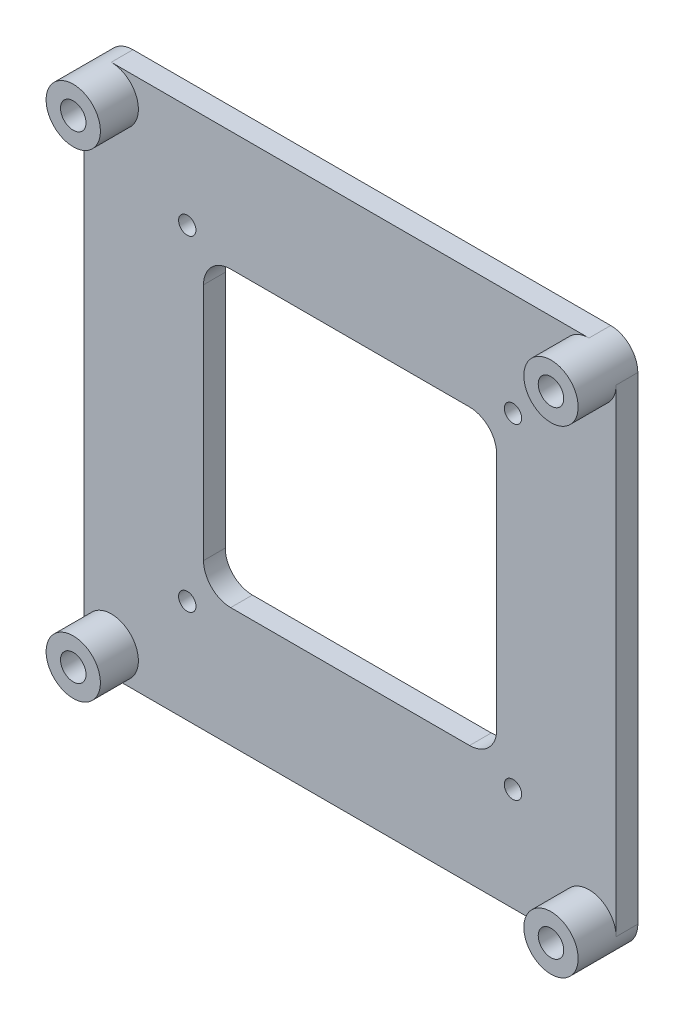
ISO-10303-21;
HEADER;
FILE_DESCRIPTION(('STEP AP214'),'2;1');
FILE_NAME('part.step','',(''),(''),'','','');
FILE_SCHEMA(('AUTOMOTIVE_DESIGN { 1 0 10303 214 1 1 1 1 }'));
ENDSEC;
DATA;
#1=APPLICATION_CONTEXT('core data for automotive mechanical design processes');
#2=APPLICATION_PROTOCOL_DEFINITION('international standard','automotive_design',2000,#1);
#3=PRODUCT_CONTEXT('',#1,'mechanical');
#4=PRODUCT('Part','Part','',(#3));
#5=PRODUCT_RELATED_PRODUCT_CATEGORY('part','',(#4));
#6=PRODUCT_DEFINITION_FORMATION('','',#4);
#7=PRODUCT_DEFINITION_CONTEXT('part definition',#1,'design');
#8=PRODUCT_DEFINITION('design','',#6,#7);
#9=PRODUCT_DEFINITION_SHAPE('','',#8);
#10=(LENGTH_UNIT() NAMED_UNIT(*) SI_UNIT(.MILLI.,.METRE.));
#11=(NAMED_UNIT(*) PLANE_ANGLE_UNIT() SI_UNIT($,.RADIAN.));
#12=(NAMED_UNIT(*) SI_UNIT($,.STERADIAN.) SOLID_ANGLE_UNIT());
#13=UNCERTAINTY_MEASURE_WITH_UNIT(LENGTH_MEASURE(1.E-05),#10,'distance_accuracy_value','');
#14=(GEOMETRIC_REPRESENTATION_CONTEXT(3) GLOBAL_UNCERTAINTY_ASSIGNED_CONTEXT((#13)) GLOBAL_UNIT_ASSIGNED_CONTEXT((#10,
#11,#12)) REPRESENTATION_CONTEXT('',''));
#15=CARTESIAN_POINT('',(0.,0.,0.));
#16=DIRECTION('',(0.,0.,1.));
#17=DIRECTION('',(1.,0.,0.));
#18=AXIS2_PLACEMENT_3D('',#15,#16,#17);
#19=CARTESIAN_POINT('',(0.,0.,0.));
#20=DIRECTION('',(0.,0.,1.));
#21=DIRECTION('',(1.,0.,0.));
#22=AXIS2_PLACEMENT_3D('',#19,#20,#21);
#23=PLANE('',#22);
#24=CARTESIAN_POINT('',(30.,30.,0.));
#25=DIRECTION('',(0.,0.,-1.));
#26=DIRECTION('',(1.,0.,0.));
#27=AXIS2_PLACEMENT_3D('',#24,#25,#26);
#28=CIRCLE('',#27,1.6);
#29=CARTESIAN_POINT('',(28.4,30.,0.));
#30=VERTEX_POINT('',#29);
#31=EDGE_CURVE('E338',#30,#30,#28,.T.);
#32=ORIENTED_EDGE('',*,*,#31,.F.);
#33=EDGE_LOOP('',(#32));
#34=FACE_BOUND('',#33,.T.);
#35=CARTESIAN_POINT('',(-30.,30.,0.));
#36=DIRECTION('',(0.,0.,-1.));
#37=DIRECTION('',(1.,0.,0.));
#38=AXIS2_PLACEMENT_3D('',#35,#36,#37);
#39=CIRCLE('',#38,1.6);
#40=CARTESIAN_POINT('',(-31.6,30.,0.));
#41=VERTEX_POINT('',#40);
#42=EDGE_CURVE('E322',#41,#41,#39,.T.);
#43=ORIENTED_EDGE('',*,*,#42,.F.);
#44=EDGE_LOOP('',(#43));
#45=FACE_BOUND('',#44,.T.);
#46=CARTESIAN_POINT('',(-30.,-30.,0.));
#47=DIRECTION('',(0.,0.,-1.));
#48=DIRECTION('',(1.,0.,0.));
#49=AXIS2_PLACEMENT_3D('',#46,#47,#48);
#50=CIRCLE('',#49,1.6);
#51=CARTESIAN_POINT('',(-31.6,-30.,0.));
#52=VERTEX_POINT('',#51);
#53=EDGE_CURVE('E245',#52,#52,#50,.T.);
#54=ORIENTED_EDGE('',*,*,#53,.F.);
#55=EDGE_LOOP('',(#54));
#56=FACE_BOUND('',#55,.T.);
#57=CARTESIAN_POINT('',(22.,22.,0.));
#58=DIRECTION('',(0.,0.,-1.));
#59=DIRECTION('',(0.707106781186548,0.707106781186548,0.));
#60=AXIS2_PLACEMENT_3D('',#57,#58,#59);
#61=CIRCLE('',#60,5.);
#62=CARTESIAN_POINT('',(22.,27.,0.));
#63=VERTEX_POINT('',#62);
#64=CARTESIAN_POINT('',(27.,22.,0.));
#65=VERTEX_POINT('',#64);
#66=EDGE_CURVE('E797',#63,#65,#61,.T.);
#67=ORIENTED_EDGE('',*,*,#66,.F.);
#68=DIRECTION('',(1.,0.,0.));
#69=VECTOR('',#68,1.);
#70=CARTESIAN_POINT('',(-27.,27.,0.));
#71=LINE('',#70,#69);
#72=CARTESIAN_POINT('',(-22.,27.,0.));
#73=VERTEX_POINT('',#72);
#74=EDGE_CURVE('E819',#73,#63,#71,.T.);
#75=ORIENTED_EDGE('',*,*,#74,.F.);
#76=CARTESIAN_POINT('',(-22.,22.,0.));
#77=DIRECTION('',(0.,0.,-1.));
#78=DIRECTION('',(-0.707106781186548,0.707106781186548,0.));
#79=AXIS2_PLACEMENT_3D('',#76,#77,#78);
#80=CIRCLE('',#79,5.);
#81=CARTESIAN_POINT('',(-27.,22.,0.));
#82=VERTEX_POINT('',#81);
#83=EDGE_CURVE('E847',#82,#73,#80,.T.);
#84=ORIENTED_EDGE('',*,*,#83,.F.);
#85=DIRECTION('',(0.,1.,0.));
#86=VECTOR('',#85,1.);
#87=CARTESIAN_POINT('',(-27.,-27.,0.));
#88=LINE('',#87,#86);
#89=CARTESIAN_POINT('',(-27.,-22.,0.));
#90=VERTEX_POINT('',#89);
#91=EDGE_CURVE('E678',#90,#82,#88,.T.);
#92=ORIENTED_EDGE('',*,*,#91,.F.);
#93=CARTESIAN_POINT('',(-22.,-22.,0.));
#94=DIRECTION('',(0.,0.,-1.));
#95=DIRECTION('',(-0.707106781186548,-0.707106781186548,0.));
#96=AXIS2_PLACEMENT_3D('',#93,#94,#95);
#97=CIRCLE('',#96,5.);
#98=CARTESIAN_POINT('',(-22.,-27.,0.));
#99=VERTEX_POINT('',#98);
#100=EDGE_CURVE('E708',#99,#90,#97,.T.);
#101=ORIENTED_EDGE('',*,*,#100,.F.);
#102=DIRECTION('',(-1.,0.,0.));
#103=VECTOR('',#102,1.);
#104=CARTESIAN_POINT('',(27.,-27.,0.));
#105=LINE('',#104,#103);
#106=CARTESIAN_POINT('',(22.,-27.,0.));
#107=VERTEX_POINT('',#106);
#108=EDGE_CURVE('E731',#107,#99,#105,.T.);
#109=ORIENTED_EDGE('',*,*,#108,.F.);
#110=CARTESIAN_POINT('',(22.,-22.,0.));
#111=DIRECTION('',(0.,0.,-1.));
#112=DIRECTION('',(0.707106781186548,-0.707106781186548,0.));
#113=AXIS2_PLACEMENT_3D('',#110,#111,#112);
#114=CIRCLE('',#113,5.);
#115=CARTESIAN_POINT('',(27.,-22.,0.));
#116=VERTEX_POINT('',#115);
#117=EDGE_CURVE('E753',#116,#107,#114,.T.);
#118=ORIENTED_EDGE('',*,*,#117,.F.);
#119=DIRECTION('',(0.,-1.,0.));
#120=VECTOR('',#119,1.);
#121=CARTESIAN_POINT('',(27.,27.,0.));
#122=LINE('',#121,#120);
#123=EDGE_CURVE('E777',#65,#116,#122,.T.);
#124=ORIENTED_EDGE('',*,*,#123,.F.);
#125=EDGE_LOOP('',(#67,#75,#84,#92,#101,#109,#118,#124));
#126=FACE_BOUND('',#125,.T.);
#127=CARTESIAN_POINT('',(30.,-30.,0.));
#128=DIRECTION('',(0.,0.,-1.));
#129=DIRECTION('',(1.,0.,0.));
#130=AXIS2_PLACEMENT_3D('',#127,#128,#129);
#131=CIRCLE('',#130,1.6);
#132=CARTESIAN_POINT('',(28.4,-30.,0.));
#133=VERTEX_POINT('',#132);
#134=EDGE_CURVE('E229',#133,#133,#131,.T.);
#135=ORIENTED_EDGE('',*,*,#134,.F.);
#136=EDGE_LOOP('',(#135));
#137=FACE_BOUND('',#136,.T.);
#138=CARTESIAN_POINT('',(44.,44.,0.));
#139=DIRECTION('',(0.,0.,-1.));
#140=DIRECTION('',(1.,0.,0.));
#141=AXIS2_PLACEMENT_3D('',#138,#139,#140);
#142=CIRCLE('',#141,2.35);
#143=CARTESIAN_POINT('',(41.65,44.,0.));
#144=VERTEX_POINT('',#143);
#145=EDGE_CURVE('E243',#144,#144,#142,.T.);
#146=ORIENTED_EDGE('',*,*,#145,.F.);
#147=EDGE_LOOP('',(#146));
#148=FACE_BOUND('',#147,.T.);
#149=CARTESIAN_POINT('',(44.,-44.,0.));
#150=DIRECTION('',(0.,0.,-1.));
#151=DIRECTION('',(1.,0.,0.));
#152=AXIS2_PLACEMENT_3D('',#149,#150,#151);
#153=CIRCLE('',#152,2.35);
#154=CARTESIAN_POINT('',(41.65,-44.,0.));
#155=VERTEX_POINT('',#154);
#156=EDGE_CURVE('E254',#155,#155,#153,.T.);
#157=ORIENTED_EDGE('',*,*,#156,.F.);
#158=EDGE_LOOP('',(#157));
#159=FACE_BOUND('',#158,.T.);
#160=CARTESIAN_POINT('',(-44.,-44.,0.));
#161=DIRECTION('',(0.,0.,-1.));
#162=DIRECTION('',(1.,0.,0.));
#163=AXIS2_PLACEMENT_3D('',#160,#161,#162);
#164=CIRCLE('',#163,2.35);
#165=CARTESIAN_POINT('',(-46.35,-44.,0.));
#166=VERTEX_POINT('',#165);
#167=EDGE_CURVE('E48',#166,#166,#164,.T.);
#168=ORIENTED_EDGE('',*,*,#167,.F.);
#169=EDGE_LOOP('',(#168));
#170=FACE_BOUND('',#169,.T.);
#171=CARTESIAN_POINT('',(-44.,44.,0.));
#172=DIRECTION('',(0.,0.,-1.));
#173=DIRECTION('',(1.,0.,0.));
#174=AXIS2_PLACEMENT_3D('',#171,#172,#173);
#175=CIRCLE('',#174,2.35);
#176=CARTESIAN_POINT('',(-46.35,44.,0.));
#177=VERTEX_POINT('',#176);
#178=EDGE_CURVE('E25',#177,#177,#175,.T.);
#179=ORIENTED_EDGE('',*,*,#178,.F.);
#180=EDGE_LOOP('',(#179));
#181=FACE_BOUND('',#180,.T.);
#182=CARTESIAN_POINT('',(-44.,44.,0.));
#183=DIRECTION('',(0.,0.,1.));
#184=DIRECTION('',(-0.707106781186548,0.707106781186548,0.));
#185=AXIS2_PLACEMENT_3D('',#182,#183,#184);
#186=CIRCLE('',#185,5.);
#187=CARTESIAN_POINT('',(-44.,49.,0.));
#188=VERTEX_POINT('',#187);
#189=CARTESIAN_POINT('',(-49.,44.,0.));
#190=VERTEX_POINT('',#189);
#191=EDGE_CURVE('E393',#188,#190,#186,.T.);
#192=ORIENTED_EDGE('',*,*,#191,.F.);
#193=DIRECTION('',(-1.,0.,0.));
#194=VECTOR('',#193,1.);
#195=CARTESIAN_POINT('',(49.,49.,0.));
#196=LINE('',#195,#194);
#197=CARTESIAN_POINT('',(44.,49.,0.));
#198=VERTEX_POINT('',#197);
#199=EDGE_CURVE('E10',#198,#188,#196,.T.);
#200=ORIENTED_EDGE('',*,*,#199,.F.);
#201=CARTESIAN_POINT('',(44.,44.,0.));
#202=DIRECTION('',(0.,0.,1.));
#203=DIRECTION('',(0.707106781186548,0.707106781186548,0.));
#204=AXIS2_PLACEMENT_3D('',#201,#202,#203);
#205=CIRCLE('',#204,5.);
#206=CARTESIAN_POINT('',(49.,44.,0.));
#207=VERTEX_POINT('',#206);
#208=EDGE_CURVE('E556',#207,#198,#205,.T.);
#209=ORIENTED_EDGE('',*,*,#208,.F.);
#210=DIRECTION('',(0.,1.,0.));
#211=VECTOR('',#210,1.);
#212=CARTESIAN_POINT('',(49.,-49.,0.));
#213=LINE('',#212,#211);
#214=CARTESIAN_POINT('',(49.,-44.,0.));
#215=VERTEX_POINT('',#214);
#216=EDGE_CURVE('E614',#215,#207,#213,.T.);
#217=ORIENTED_EDGE('',*,*,#216,.F.);
#218=CARTESIAN_POINT('',(44.,-44.,0.));
#219=DIRECTION('',(0.,0.,1.));
#220=DIRECTION('',(0.707106781186548,-0.707106781186548,0.));
#221=AXIS2_PLACEMENT_3D('',#218,#219,#220);
#222=CIRCLE('',#221,5.);
#223=CARTESIAN_POINT('',(44.,-49.,0.));
#224=VERTEX_POINT('',#223);
#225=EDGE_CURVE('E432',#224,#215,#222,.T.);
#226=ORIENTED_EDGE('',*,*,#225,.F.);
#227=DIRECTION('',(1.,0.,0.));
#228=VECTOR('',#227,1.);
#229=CARTESIAN_POINT('',(-49.,-49.,0.));
#230=LINE('',#229,#228);
#231=CARTESIAN_POINT('',(-44.,-49.,0.));
#232=VERTEX_POINT('',#231);
#233=EDGE_CURVE('E580',#232,#224,#230,.T.);
#234=ORIENTED_EDGE('',*,*,#233,.F.);
#235=CARTESIAN_POINT('',(-44.,-44.,0.));
#236=DIRECTION('',(0.,0.,1.));
#237=DIRECTION('',(-0.707106781186548,-0.707106781186548,0.));
#238=AXIS2_PLACEMENT_3D('',#235,#236,#237);
#239=CIRCLE('',#238,5.);
#240=CARTESIAN_POINT('',(-49.,-44.,0.));
#241=VERTEX_POINT('',#240);
#242=EDGE_CURVE('E361',#241,#232,#239,.T.);
#243=ORIENTED_EDGE('',*,*,#242,.F.);
#244=DIRECTION('',(0.,-1.,0.));
#245=VECTOR('',#244,1.);
#246=CARTESIAN_POINT('',(-49.,49.,0.));
#247=LINE('',#246,#245);
#248=EDGE_CURVE('E662',#190,#241,#247,.T.);
#249=ORIENTED_EDGE('',*,*,#248,.F.);
#250=EDGE_LOOP('',(#192,#200,#209,#217,#226,#234,#243,#249));
#251=FACE_BOUND('',#250,.T.);
#252=ADVANCED_FACE('F16',(#34,#45,#56,#126,#137,#148,#159,#170,#181,#251),#23,.F.);
#253=CARTESIAN_POINT('',(49.,49.,0.));
#254=DIRECTION('',(0.,1.,0.));
#255=DIRECTION('',(1.,0.,0.));
#256=AXIS2_PLACEMENT_3D('',#253,#254,#255);
#257=PLANE('',#256);
#258=DIRECTION('',(0.,0.,-1.));
#259=VECTOR('',#258,1.);
#260=CARTESIAN_POINT('',(-44.,49.,0.));
#261=LINE('',#260,#259);
#262=CARTESIAN_POINT('',(-44.,49.,4.));
#263=VERTEX_POINT('',#262);
#264=EDGE_CURVE('E400',#263,#188,#261,.T.);
#265=ORIENTED_EDGE('',*,*,#264,.F.);
#266=DIRECTION('',(-1.,0.,0.));
#267=VECTOR('',#266,1.);
#268=CARTESIAN_POINT('',(49.,49.,4.));
#269=LINE('',#268,#267);
#270=CARTESIAN_POINT('',(44.,49.,4.));
#271=VERTEX_POINT('',#270);
#272=EDGE_CURVE('E528',#271,#263,#269,.T.);
#273=ORIENTED_EDGE('',*,*,#272,.F.);
#274=DIRECTION('',(0.,0.,1.));
#275=VECTOR('',#274,1.);
#276=CARTESIAN_POINT('',(44.,49.,0.));
#277=LINE('',#276,#275);
#278=EDGE_CURVE('E549',#198,#271,#277,.T.);
#279=ORIENTED_EDGE('',*,*,#278,.F.);
#280=ORIENTED_EDGE('',*,*,#199,.T.);
#281=EDGE_LOOP('',(#265,#273,#279,#280));
#282=FACE_BOUND('',#281,.T.);
#283=ADVANCED_FACE('F18',(#282),#257,.T.);
#284=CARTESIAN_POINT('',(-44.,44.,0.));
#285=DIRECTION('',(0.,0.,1.));
#286=DIRECTION('',(1.,0.,0.));
#287=AXIS2_PLACEMENT_3D('',#284,#285,#286);
#288=CYLINDRICAL_SURFACE('',#287,2.35);
#289=CARTESIAN_POINT('',(-44.,44.,11.));
#290=DIRECTION('',(0.,0.,-1.));
#291=DIRECTION('',(-1.,0.,0.));
#292=AXIS2_PLACEMENT_3D('',#289,#290,#291);
#293=CIRCLE('',#292,2.35);
#294=CARTESIAN_POINT('',(-46.35,44.,11.));
#295=VERTEX_POINT('',#294);
#296=EDGE_CURVE('E385',#295,#295,#293,.T.);
#297=ORIENTED_EDGE('',*,*,#296,.F.);
#298=DIRECTION('',(0.,0.,-1.));
#299=VECTOR('',#298,1.);
#300=CARTESIAN_POINT('',(-46.35,44.,0.));
#301=LINE('',#300,#299);
#302=EDGE_CURVE('E258',#295,#177,#301,.T.);
#303=ORIENTED_EDGE('',*,*,#302,.T.);
#304=ORIENTED_EDGE('',*,*,#178,.T.);
#305=ORIENTED_EDGE('',*,*,#302,.F.);
#306=EDGE_LOOP('',(#297,#303,#304,#305));
#307=FACE_BOUND('',#306,.T.);
#308=ADVANCED_FACE('F913',(#307),#288,.F.);
#309=CARTESIAN_POINT('',(-44.,-44.,0.));
#310=DIRECTION('',(0.,0.,1.));
#311=DIRECTION('',(1.,0.,0.));
#312=AXIS2_PLACEMENT_3D('',#309,#310,#311);
#313=CYLINDRICAL_SURFACE('',#312,2.35);
#314=CARTESIAN_POINT('',(-44.,-44.,11.));
#315=DIRECTION('',(0.,0.,-1.));
#316=DIRECTION('',(-1.,0.,0.));
#317=AXIS2_PLACEMENT_3D('',#314,#315,#316);
#318=CIRCLE('',#317,2.35);
#319=CARTESIAN_POINT('',(-46.35,-44.,11.));
#320=VERTEX_POINT('',#319);
#321=EDGE_CURVE('E352',#320,#320,#318,.T.);
#322=ORIENTED_EDGE('',*,*,#321,.F.);
#323=DIRECTION('',(0.,0.,-1.));
#324=VECTOR('',#323,1.);
#325=CARTESIAN_POINT('',(-46.35,-44.,0.));
#326=LINE('',#325,#324);
#327=EDGE_CURVE('E257',#320,#166,#326,.T.);
#328=ORIENTED_EDGE('',*,*,#327,.T.);
#329=ORIENTED_EDGE('',*,*,#167,.T.);
#330=ORIENTED_EDGE('',*,*,#327,.F.);
#331=EDGE_LOOP('',(#322,#328,#329,#330));
#332=FACE_BOUND('',#331,.T.);
#333=ADVANCED_FACE('F1020',(#332),#313,.F.);
#334=CARTESIAN_POINT('',(44.,-44.,0.));
#335=DIRECTION('',(0.,0.,1.));
#336=DIRECTION('',(1.,0.,0.));
#337=AXIS2_PLACEMENT_3D('',#334,#335,#336);
#338=CYLINDRICAL_SURFACE('',#337,2.35);
#339=CARTESIAN_POINT('',(44.,-44.,11.));
#340=DIRECTION('',(0.,0.,-1.));
#341=DIRECTION('',(-1.,0.,0.));
#342=AXIS2_PLACEMENT_3D('',#339,#340,#341);
#343=CIRCLE('',#342,2.35);
#344=CARTESIAN_POINT('',(41.65,-44.,11.));
#345=VERTEX_POINT('',#344);
#346=EDGE_CURVE('E423',#345,#345,#343,.T.);
#347=ORIENTED_EDGE('',*,*,#346,.F.);
#348=DIRECTION('',(0.,0.,-1.));
#349=VECTOR('',#348,1.);
#350=CARTESIAN_POINT('',(41.65,-44.,0.));
#351=LINE('',#350,#349);
#352=EDGE_CURVE('E253',#345,#155,#351,.T.);
#353=ORIENTED_EDGE('',*,*,#352,.T.);
#354=ORIENTED_EDGE('',*,*,#156,.T.);
#355=ORIENTED_EDGE('',*,*,#352,.F.);
#356=EDGE_LOOP('',(#347,#353,#354,#355));
#357=FACE_BOUND('',#356,.T.);
#358=ADVANCED_FACE('F1016',(#357),#338,.F.);
#359=CARTESIAN_POINT('',(44.,44.,0.));
#360=DIRECTION('',(0.,0.,1.));
#361=DIRECTION('',(1.,0.,0.));
#362=AXIS2_PLACEMENT_3D('',#359,#360,#361);
#363=CYLINDRICAL_SURFACE('',#362,2.35);
#364=CARTESIAN_POINT('',(44.,44.,11.));
#365=DIRECTION('',(0.,0.,-1.));
#366=DIRECTION('',(-1.,0.,0.));
#367=AXIS2_PLACEMENT_3D('',#364,#365,#366);
#368=CIRCLE('',#367,2.35);
#369=CARTESIAN_POINT('',(41.65,44.,11.));
#370=VERTEX_POINT('',#369);
#371=EDGE_CURVE('E535',#370,#370,#368,.T.);
#372=ORIENTED_EDGE('',*,*,#371,.F.);
#373=DIRECTION('',(0.,0.,-1.));
#374=VECTOR('',#373,1.);
#375=CARTESIAN_POINT('',(41.65,44.,0.));
#376=LINE('',#375,#374);
#377=EDGE_CURVE('E236',#370,#144,#376,.T.);
#378=ORIENTED_EDGE('',*,*,#377,.T.);
#379=ORIENTED_EDGE('',*,*,#145,.T.);
#380=ORIENTED_EDGE('',*,*,#377,.F.);
#381=EDGE_LOOP('',(#372,#378,#379,#380));
#382=FACE_BOUND('',#381,.T.);
#383=ADVANCED_FACE('F1013',(#382),#363,.F.);
#384=CARTESIAN_POINT('',(30.,-30.,0.));
#385=DIRECTION('',(0.,0.,1.));
#386=DIRECTION('',(1.,0.,0.));
#387=AXIS2_PLACEMENT_3D('',#384,#385,#386);
#388=CYLINDRICAL_SURFACE('',#387,1.6);
#389=CARTESIAN_POINT('',(30.,-30.,4.));
#390=DIRECTION('',(0.,0.,-1.));
#391=DIRECTION('',(1.,0.,0.));
#392=AXIS2_PLACEMENT_3D('',#389,#390,#391);
#393=CIRCLE('',#392,1.6);
#394=CARTESIAN_POINT('',(28.4,-30.,4.));
#395=VERTEX_POINT('',#394);
#396=EDGE_CURVE('E455',#395,#395,#393,.T.);
#397=ORIENTED_EDGE('',*,*,#396,.F.);
#398=DIRECTION('',(0.,0.,-1.));
#399=VECTOR('',#398,1.);
#400=CARTESIAN_POINT('',(28.4,-30.,0.));
#401=LINE('',#400,#399);
#402=EDGE_CURVE('E232',#395,#133,#401,.T.);
#403=ORIENTED_EDGE('',*,*,#402,.T.);
#404=ORIENTED_EDGE('',*,*,#134,.T.);
#405=ORIENTED_EDGE('',*,*,#402,.F.);
#406=EDGE_LOOP('',(#397,#403,#404,#405));
#407=FACE_BOUND('',#406,.T.);
#408=ADVANCED_FACE('F231',(#407),#388,.F.);
#409=CARTESIAN_POINT('',(-30.,-30.,0.));
#410=DIRECTION('',(0.,0.,1.));
#411=DIRECTION('',(1.,0.,0.));
#412=AXIS2_PLACEMENT_3D('',#409,#410,#411);
#413=CYLINDRICAL_SURFACE('',#412,1.6);
#414=CARTESIAN_POINT('',(-30.,-30.,4.));
#415=DIRECTION('',(0.,0.,-1.));
#416=DIRECTION('',(1.,0.,0.));
#417=AXIS2_PLACEMENT_3D('',#414,#415,#416);
#418=CIRCLE('',#417,1.6);
#419=CARTESIAN_POINT('',(-31.6,-30.,4.));
#420=VERTEX_POINT('',#419);
#421=EDGE_CURVE('E462',#420,#420,#418,.T.);
#422=ORIENTED_EDGE('',*,*,#421,.F.);
#423=DIRECTION('',(0.,0.,-1.));
#424=VECTOR('',#423,1.);
#425=CARTESIAN_POINT('',(-31.6,-30.,0.));
#426=LINE('',#425,#424);
#427=EDGE_CURVE('E249',#420,#52,#426,.T.);
#428=ORIENTED_EDGE('',*,*,#427,.T.);
#429=ORIENTED_EDGE('',*,*,#53,.T.);
#430=ORIENTED_EDGE('',*,*,#427,.F.);
#431=EDGE_LOOP('',(#422,#428,#429,#430));
#432=FACE_BOUND('',#431,.T.);
#433=ADVANCED_FACE('F1006',(#432),#413,.F.);
#434=CARTESIAN_POINT('',(-30.,30.,0.));
#435=DIRECTION('',(0.,0.,1.));
#436=DIRECTION('',(1.,0.,0.));
#437=AXIS2_PLACEMENT_3D('',#434,#435,#436);
#438=CYLINDRICAL_SURFACE('',#437,1.6);
#439=CARTESIAN_POINT('',(-30.,30.,4.));
#440=DIRECTION('',(0.,0.,-1.));
#441=DIRECTION('',(1.,0.,0.));
#442=AXIS2_PLACEMENT_3D('',#439,#440,#441);
#443=CIRCLE('',#442,1.6);
#444=CARTESIAN_POINT('',(-31.6,30.,4.));
#445=VERTEX_POINT('',#444);
#446=EDGE_CURVE('E470',#445,#445,#443,.T.);
#447=ORIENTED_EDGE('',*,*,#446,.F.);
#448=DIRECTION('',(0.,0.,-1.));
#449=VECTOR('',#448,1.);
#450=CARTESIAN_POINT('',(-31.6,30.,0.));
#451=LINE('',#450,#449);
#452=EDGE_CURVE('E329',#445,#41,#451,.T.);
#453=ORIENTED_EDGE('',*,*,#452,.T.);
#454=ORIENTED_EDGE('',*,*,#42,.T.);
#455=ORIENTED_EDGE('',*,*,#452,.F.);
#456=EDGE_LOOP('',(#447,#453,#454,#455));
#457=FACE_BOUND('',#456,.T.);
#458=ADVANCED_FACE('F999',(#457),#438,.F.);
#459=CARTESIAN_POINT('',(30.,30.,0.));
#460=DIRECTION('',(0.,0.,1.));
#461=DIRECTION('',(1.,0.,0.));
#462=AXIS2_PLACEMENT_3D('',#459,#460,#461);
#463=CYLINDRICAL_SURFACE('',#462,1.6);
#464=CARTESIAN_POINT('',(30.,30.,4.));
#465=DIRECTION('',(0.,0.,-1.));
#466=DIRECTION('',(1.,0.,0.));
#467=AXIS2_PLACEMENT_3D('',#464,#465,#466);
#468=CIRCLE('',#467,1.6);
#469=CARTESIAN_POINT('',(28.4,30.,4.));
#470=VERTEX_POINT('',#469);
#471=EDGE_CURVE('E478',#470,#470,#468,.T.);
#472=ORIENTED_EDGE('',*,*,#471,.F.);
#473=DIRECTION('',(0.,0.,-1.));
#474=VECTOR('',#473,1.);
#475=CARTESIAN_POINT('',(28.4,30.,0.));
#476=LINE('',#475,#474);
#477=EDGE_CURVE('E344',#470,#30,#476,.T.);
#478=ORIENTED_EDGE('',*,*,#477,.T.);
#479=ORIENTED_EDGE('',*,*,#31,.T.);
#480=ORIENTED_EDGE('',*,*,#477,.F.);
#481=EDGE_LOOP('',(#472,#478,#479,#480));
#482=FACE_BOUND('',#481,.T.);
#483=ADVANCED_FACE('F990',(#482),#463,.F.);
#484=CARTESIAN_POINT('',(-44.,-44.,11.));
#485=DIRECTION('',(0.,0.,1.));
#486=DIRECTION('',(1.,0.,0.));
#487=AXIS2_PLACEMENT_3D('',#484,#485,#486);
#488=PLANE('',#487);
#489=ORIENTED_EDGE('',*,*,#321,.T.);
#490=EDGE_LOOP('',(#489));
#491=FACE_BOUND('',#490,.T.);
#492=CARTESIAN_POINT('',(-44.,-44.,11.));
#493=DIRECTION('',(0.,0.,1.));
#494=DIRECTION('',(-1.,0.,0.));
#495=AXIS2_PLACEMENT_3D('',#492,#493,#494);
#496=CIRCLE('',#495,5.);
#497=CARTESIAN_POINT('',(-39.,-44.,11.));
#498=VERTEX_POINT('',#497);
#499=EDGE_CURVE('E377',#498,#498,#496,.T.);
#500=ORIENTED_EDGE('',*,*,#499,.T.);
#501=EDGE_LOOP('',(#500));
#502=FACE_BOUND('',#501,.T.);
#503=ADVANCED_FACE('F988',(#491,#502),#488,.T.);
#504=CARTESIAN_POINT('',(-44.,-44.,4.));
#505=DIRECTION('',(0.,0.,1.));
#506=DIRECTION('',(-1.,0.,0.));
#507=AXIS2_PLACEMENT_3D('',#504,#505,#506);
#508=CYLINDRICAL_SURFACE('',#507,5.);
#509=ORIENTED_EDGE('',*,*,#499,.F.);
#510=DIRECTION('',(0.,0.,-1.));
#511=VECTOR('',#510,1.);
#512=CARTESIAN_POINT('',(-39.,-44.,4.));
#513=LINE('',#512,#511);
#514=CARTESIAN_POINT('',(-39.,-44.,4.));
#515=VERTEX_POINT('',#514);
#516=EDGE_CURVE('E368',#498,#515,#513,.T.);
#517=ORIENTED_EDGE('',*,*,#516,.T.);
#518=CARTESIAN_POINT('',(-44.,-44.,4.));
#519=DIRECTION('',(0.,0.,-1.));
#520=DIRECTION('',(-1.,0.,0.));
#521=AXIS2_PLACEMENT_3D('',#518,#519,#520);
#522=CIRCLE('',#521,5.);
#523=CARTESIAN_POINT('',(-49.,-44.,4.));
#524=VERTEX_POINT('',#523);
#525=EDGE_CURVE('E505',#524,#515,#522,.T.);
#526=ORIENTED_EDGE('',*,*,#525,.F.);
#527=DIRECTION('',(0.,0.,-1.));
#528=VECTOR('',#527,1.);
#529=CARTESIAN_POINT('',(-49.,-44.,0.));
#530=LINE('',#529,#528);
#531=EDGE_CURVE('E654',#524,#241,#530,.T.);
#532=ORIENTED_EDGE('',*,*,#531,.T.);
#533=ORIENTED_EDGE('',*,*,#242,.T.);
#534=DIRECTION('',(0.,0.,1.));
#535=VECTOR('',#534,1.);
#536=CARTESIAN_POINT('',(-44.,-49.,0.));
#537=LINE('',#536,#535);
#538=CARTESIAN_POINT('',(-44.,-49.,4.));
#539=VERTEX_POINT('',#538);
#540=EDGE_CURVE('E588',#232,#539,#537,.T.);
#541=ORIENTED_EDGE('',*,*,#540,.T.);
#542=CARTESIAN_POINT('',(-44.,-44.,4.));
#543=DIRECTION('',(0.,0.,-1.));
#544=DIRECTION('',(-1.,0.,0.));
#545=AXIS2_PLACEMENT_3D('',#542,#543,#544);
#546=CIRCLE('',#545,5.);
#547=EDGE_CURVE('E497',#515,#539,#546,.T.);
#548=ORIENTED_EDGE('',*,*,#547,.F.);
#549=ORIENTED_EDGE('',*,*,#516,.F.);
#550=EDGE_LOOP('',(#509,#517,#526,#532,#533,#541,#548,#549));
#551=FACE_BOUND('',#550,.T.);
#552=ADVANCED_FACE('F986',(#551),#508,.T.);
#553=CARTESIAN_POINT('',(-44.,44.,11.));
#554=DIRECTION('',(0.,0.,1.));
#555=DIRECTION('',(1.,0.,0.));
#556=AXIS2_PLACEMENT_3D('',#553,#554,#555);
#557=PLANE('',#556);
#558=ORIENTED_EDGE('',*,*,#296,.T.);
#559=EDGE_LOOP('',(#558));
#560=FACE_BOUND('',#559,.T.);
#561=CARTESIAN_POINT('',(-44.,44.,11.));
#562=DIRECTION('',(0.,0.,1.));
#563=DIRECTION('',(-1.,0.,0.));
#564=AXIS2_PLACEMENT_3D('',#561,#562,#563);
#565=CIRCLE('',#564,5.);
#566=CARTESIAN_POINT('',(-39.,44.,11.));
#567=VERTEX_POINT('',#566);
#568=EDGE_CURVE('E415',#567,#567,#565,.T.);
#569=ORIENTED_EDGE('',*,*,#568,.T.);
#570=EDGE_LOOP('',(#569));
#571=FACE_BOUND('',#570,.T.);
#572=ADVANCED_FACE('F997',(#560,#571),#557,.T.);
#573=CARTESIAN_POINT('',(-44.,44.,4.));
#574=DIRECTION('',(0.,0.,1.));
#575=DIRECTION('',(-1.,0.,0.));
#576=AXIS2_PLACEMENT_3D('',#573,#574,#575);
#577=CYLINDRICAL_SURFACE('',#576,5.);
#578=ORIENTED_EDGE('',*,*,#568,.F.);
#579=DIRECTION('',(0.,0.,-1.));
#580=VECTOR('',#579,1.);
#581=CARTESIAN_POINT('',(-39.,44.,4.));
#582=LINE('',#581,#580);
#583=CARTESIAN_POINT('',(-39.,44.,4.));
#584=VERTEX_POINT('',#583);
#585=EDGE_CURVE('E408',#567,#584,#582,.T.);
#586=ORIENTED_EDGE('',*,*,#585,.T.);
#587=CARTESIAN_POINT('',(-44.,44.,4.));
#588=DIRECTION('',(0.,0.,-1.));
#589=DIRECTION('',(-1.,0.,0.));
#590=AXIS2_PLACEMENT_3D('',#587,#588,#589);
#591=CIRCLE('',#590,5.);
#592=EDGE_CURVE('E520',#263,#584,#591,.T.);
#593=ORIENTED_EDGE('',*,*,#592,.F.);
#594=ORIENTED_EDGE('',*,*,#264,.T.);
#595=ORIENTED_EDGE('',*,*,#191,.T.);
#596=DIRECTION('',(0.,0.,1.));
#597=VECTOR('',#596,1.);
#598=CARTESIAN_POINT('',(-49.,44.,0.));
#599=LINE('',#598,#597);
#600=CARTESIAN_POINT('',(-49.,44.,4.));
#601=VERTEX_POINT('',#600);
#602=EDGE_CURVE('E670',#190,#601,#599,.T.);
#603=ORIENTED_EDGE('',*,*,#602,.T.);
#604=CARTESIAN_POINT('',(-44.,44.,4.));
#605=DIRECTION('',(0.,0.,-1.));
#606=DIRECTION('',(-1.,0.,0.));
#607=AXIS2_PLACEMENT_3D('',#604,#605,#606);
#608=CIRCLE('',#607,5.);
#609=EDGE_CURVE('E513',#584,#601,#608,.T.);
#610=ORIENTED_EDGE('',*,*,#609,.F.);
#611=ORIENTED_EDGE('',*,*,#585,.F.);
#612=EDGE_LOOP('',(#578,#586,#593,#594,#595,#603,#610,#611));
#613=FACE_BOUND('',#612,.T.);
#614=ADVANCED_FACE('F945',(#613),#577,.T.);
#615=CARTESIAN_POINT('',(44.,-44.,11.));
#616=DIRECTION('',(0.,0.,1.));
#617=DIRECTION('',(1.,0.,0.));
#618=AXIS2_PLACEMENT_3D('',#615,#616,#617);
#619=PLANE('',#618);
#620=ORIENTED_EDGE('',*,*,#346,.T.);
#621=EDGE_LOOP('',(#620));
#622=FACE_BOUND('',#621,.T.);
#623=CARTESIAN_POINT('',(44.,-44.,11.));
#624=DIRECTION('',(0.,0.,1.));
#625=DIRECTION('',(-1.,0.,0.));
#626=AXIS2_PLACEMENT_3D('',#623,#624,#625);
#627=CIRCLE('',#626,5.);
#628=CARTESIAN_POINT('',(49.,-44.,11.));
#629=VERTEX_POINT('',#628);
#630=EDGE_CURVE('E447',#629,#629,#627,.T.);
#631=ORIENTED_EDGE('',*,*,#630,.T.);
#632=EDGE_LOOP('',(#631));
#633=FACE_BOUND('',#632,.T.);
#634=ADVANCED_FACE('F941',(#622,#633),#619,.T.);
#635=CARTESIAN_POINT('',(44.,-44.,4.));
#636=DIRECTION('',(0.,0.,1.));
#637=DIRECTION('',(-1.,0.,0.));
#638=AXIS2_PLACEMENT_3D('',#635,#636,#637);
#639=CYLINDRICAL_SURFACE('',#638,5.);
#640=ORIENTED_EDGE('',*,*,#630,.F.);
#641=DIRECTION('',(0.,0.,-1.));
#642=VECTOR('',#641,1.);
#643=CARTESIAN_POINT('',(49.,-44.,4.));
#644=LINE('',#643,#642);
#645=CARTESIAN_POINT('',(49.,-44.,4.));
#646=VERTEX_POINT('',#645);
#647=EDGE_CURVE('E440',#629,#646,#644,.T.);
#648=ORIENTED_EDGE('',*,*,#647,.T.);
#649=CARTESIAN_POINT('',(44.,-44.,4.));
#650=DIRECTION('',(0.,0.,-1.));
#651=DIRECTION('',(-1.,0.,0.));
#652=AXIS2_PLACEMENT_3D('',#649,#650,#651);
#653=CIRCLE('',#652,5.);
#654=CARTESIAN_POINT('',(44.,-49.,4.));
#655=VERTEX_POINT('',#654);
#656=EDGE_CURVE('E487',#655,#646,#653,.T.);
#657=ORIENTED_EDGE('',*,*,#656,.F.);
#658=DIRECTION('',(0.,0.,-1.));
#659=VECTOR('',#658,1.);
#660=CARTESIAN_POINT('',(44.,-49.,0.));
#661=LINE('',#660,#659);
#662=EDGE_CURVE('E606',#655,#224,#661,.T.);
#663=ORIENTED_EDGE('',*,*,#662,.T.);
#664=ORIENTED_EDGE('',*,*,#225,.T.);
#665=DIRECTION('',(0.,0.,1.));
#666=VECTOR('',#665,1.);
#667=CARTESIAN_POINT('',(49.,-44.,0.));
#668=LINE('',#667,#666);
#669=EDGE_CURVE('E622',#215,#646,#668,.T.);
#670=ORIENTED_EDGE('',*,*,#669,.T.);
#671=ORIENTED_EDGE('',*,*,#647,.F.);
#672=EDGE_LOOP('',(#640,#648,#657,#663,#664,#670,#671));
#673=FACE_BOUND('',#672,.T.);
#674=ADVANCED_FACE('F944',(#673),#639,.T.);
#675=CARTESIAN_POINT('',(0.,0.,4.));
#676=DIRECTION('',(0.,0.,1.));
#677=DIRECTION('',(1.,0.,0.));
#678=AXIS2_PLACEMENT_3D('',#675,#676,#677);
#679=PLANE('',#678);
#680=ORIENTED_EDGE('',*,*,#396,.T.);
#681=EDGE_LOOP('',(#680));
#682=FACE_BOUND('',#681,.T.);
#683=DIRECTION('',(0.,-1.,0.));
#684=VECTOR('',#683,1.);
#685=CARTESIAN_POINT('',(27.,27.,4.));
#686=LINE('',#685,#684);
#687=CARTESIAN_POINT('',(27.,22.,4.));
#688=VERTEX_POINT('',#687);
#689=CARTESIAN_POINT('',(27.,-22.,4.));
#690=VERTEX_POINT('',#689);
#691=EDGE_CURVE('E761',#688,#690,#686,.T.);
#692=ORIENTED_EDGE('',*,*,#691,.T.);
#693=CARTESIAN_POINT('',(22.,-22.,4.));
#694=DIRECTION('',(0.,0.,1.));
#695=DIRECTION('',(0.707106781186548,-0.707106781186548,0.));
#696=AXIS2_PLACEMENT_3D('',#693,#694,#695);
#697=CIRCLE('',#696,5.);
#698=CARTESIAN_POINT('',(22.,-27.,4.));
#699=VERTEX_POINT('',#698);
#700=EDGE_CURVE('E738',#699,#690,#697,.T.);
#701=ORIENTED_EDGE('',*,*,#700,.F.);
#702=DIRECTION('',(-1.,0.,0.));
#703=VECTOR('',#702,1.);
#704=CARTESIAN_POINT('',(27.,-27.,4.));
#705=LINE('',#704,#703);
#706=CARTESIAN_POINT('',(-22.,-27.,4.));
#707=VERTEX_POINT('',#706);
#708=EDGE_CURVE('E716',#699,#707,#705,.T.);
#709=ORIENTED_EDGE('',*,*,#708,.T.);
#710=CARTESIAN_POINT('',(-22.,-22.,4.));
#711=DIRECTION('',(0.,0.,1.));
#712=DIRECTION('',(-0.707106781186548,-0.707106781186548,0.));
#713=AXIS2_PLACEMENT_3D('',#710,#711,#712);
#714=CIRCLE('',#713,5.);
#715=CARTESIAN_POINT('',(-27.,-22.,4.));
#716=VERTEX_POINT('',#715);
#717=EDGE_CURVE('E693',#716,#707,#714,.T.);
#718=ORIENTED_EDGE('',*,*,#717,.F.);
#719=DIRECTION('',(0.,1.,0.));
#720=VECTOR('',#719,1.);
#721=CARTESIAN_POINT('',(-27.,-27.,4.));
#722=LINE('',#721,#720);
#723=CARTESIAN_POINT('',(-27.,22.,4.));
#724=VERTEX_POINT('',#723);
#725=EDGE_CURVE('E685',#716,#724,#722,.T.);
#726=ORIENTED_EDGE('',*,*,#725,.T.);
#727=CARTESIAN_POINT('',(-22.,22.,4.));
#728=DIRECTION('',(0.,0.,1.));
#729=DIRECTION('',(-0.707106781186548,0.707106781186548,0.));
#730=AXIS2_PLACEMENT_3D('',#727,#728,#729);
#731=CIRCLE('',#730,5.);
#732=CARTESIAN_POINT('',(-22.,27.,4.));
#733=VERTEX_POINT('',#732);
#734=EDGE_CURVE('E833',#733,#724,#731,.T.);
#735=ORIENTED_EDGE('',*,*,#734,.F.);
#736=DIRECTION('',(1.,0.,0.));
#737=VECTOR('',#736,1.);
#738=CARTESIAN_POINT('',(-27.,27.,4.));
#739=LINE('',#738,#737);
#740=CARTESIAN_POINT('',(22.,27.,4.));
#741=VERTEX_POINT('',#740);
#742=EDGE_CURVE('E805',#733,#741,#739,.T.);
#743=ORIENTED_EDGE('',*,*,#742,.T.);
#744=CARTESIAN_POINT('',(22.,22.,4.));
#745=DIRECTION('',(0.,0.,1.));
#746=DIRECTION('',(0.707106781186548,0.707106781186548,0.));
#747=AXIS2_PLACEMENT_3D('',#744,#745,#746);
#748=CIRCLE('',#747,5.);
#749=EDGE_CURVE('E784',#688,#741,#748,.T.);
#750=ORIENTED_EDGE('',*,*,#749,.F.);
#751=EDGE_LOOP('',(#692,#701,#709,#718,#726,#735,#743,#750));
#752=FACE_BOUND('',#751,.T.);
#753=ORIENTED_EDGE('',*,*,#421,.T.);
#754=EDGE_LOOP('',(#753));
#755=FACE_BOUND('',#754,.T.);
#756=ORIENTED_EDGE('',*,*,#446,.T.);
#757=EDGE_LOOP('',(#756));
#758=FACE_BOUND('',#757,.T.);
#759=ORIENTED_EDGE('',*,*,#471,.T.);
#760=EDGE_LOOP('',(#759));
#761=FACE_BOUND('',#760,.T.);
#762=CARTESIAN_POINT('',(44.,44.,4.));
#763=DIRECTION('',(0.,0.,-1.));
#764=DIRECTION('',(-1.,0.,0.));
#765=AXIS2_PLACEMENT_3D('',#762,#763,#764);
#766=CIRCLE('',#765,5.);
#767=CARTESIAN_POINT('',(49.,44.,4.));
#768=VERTEX_POINT('',#767);
#769=EDGE_CURVE('E542',#768,#271,#766,.T.);
#770=ORIENTED_EDGE('',*,*,#769,.T.);
#771=ORIENTED_EDGE('',*,*,#272,.T.);
#772=ORIENTED_EDGE('',*,*,#592,.T.);
#773=ORIENTED_EDGE('',*,*,#609,.T.);
#774=DIRECTION('',(0.,-1.,0.));
#775=VECTOR('',#774,1.);
#776=CARTESIAN_POINT('',(-49.,49.,4.));
#777=LINE('',#776,#775);
#778=EDGE_CURVE('E644',#601,#524,#777,.T.);
#779=ORIENTED_EDGE('',*,*,#778,.T.);
#780=ORIENTED_EDGE('',*,*,#525,.T.);
#781=ORIENTED_EDGE('',*,*,#547,.T.);
#782=DIRECTION('',(1.,0.,0.));
#783=VECTOR('',#782,1.);
#784=CARTESIAN_POINT('',(-49.,-49.,4.));
#785=LINE('',#784,#783);
#786=EDGE_CURVE('E597',#539,#655,#785,.T.);
#787=ORIENTED_EDGE('',*,*,#786,.T.);
#788=ORIENTED_EDGE('',*,*,#656,.T.);
#789=DIRECTION('',(0.,1.,0.));
#790=VECTOR('',#789,1.);
#791=CARTESIAN_POINT('',(49.,-49.,4.));
#792=LINE('',#791,#790);
#793=EDGE_CURVE('E629',#646,#768,#792,.T.);
#794=ORIENTED_EDGE('',*,*,#793,.T.);
#795=EDGE_LOOP('',(#770,#771,#772,#773,#779,#780,#781,#787,#788,#794));
#796=FACE_BOUND('',#795,.T.);
#797=ADVANCED_FACE('F888',(#682,#752,#755,#758,#761,#796),#679,.T.);
#798=CARTESIAN_POINT('',(44.,44.,11.));
#799=DIRECTION('',(0.,0.,1.));
#800=DIRECTION('',(1.,0.,0.));
#801=AXIS2_PLACEMENT_3D('',#798,#799,#800);
#802=PLANE('',#801);
#803=ORIENTED_EDGE('',*,*,#371,.T.);
#804=EDGE_LOOP('',(#803));
#805=FACE_BOUND('',#804,.T.);
#806=CARTESIAN_POINT('',(44.,44.,11.));
#807=DIRECTION('',(0.,0.,1.));
#808=DIRECTION('',(-1.,0.,0.));
#809=AXIS2_PLACEMENT_3D('',#806,#807,#808);
#810=CIRCLE('',#809,5.);
#811=CARTESIAN_POINT('',(49.,44.,11.));
#812=VERTEX_POINT('',#811);
#813=EDGE_CURVE('E572',#812,#812,#810,.T.);
#814=ORIENTED_EDGE('',*,*,#813,.T.);
#815=EDGE_LOOP('',(#814));
#816=FACE_BOUND('',#815,.T.);
#817=ADVANCED_FACE('F930',(#805,#816),#802,.T.);
#818=CARTESIAN_POINT('',(44.,44.,4.));
#819=DIRECTION('',(0.,0.,1.));
#820=DIRECTION('',(-1.,0.,0.));
#821=AXIS2_PLACEMENT_3D('',#818,#819,#820);
#822=CYLINDRICAL_SURFACE('',#821,5.);
#823=ORIENTED_EDGE('',*,*,#813,.F.);
#824=DIRECTION('',(0.,0.,-1.));
#825=VECTOR('',#824,1.);
#826=CARTESIAN_POINT('',(49.,44.,4.));
#827=LINE('',#826,#825);
#828=EDGE_CURVE('E564',#812,#768,#827,.T.);
#829=ORIENTED_EDGE('',*,*,#828,.T.);
#830=DIRECTION('',(0.,0.,-1.));
#831=VECTOR('',#830,1.);
#832=CARTESIAN_POINT('',(49.,44.,0.));
#833=LINE('',#832,#831);
#834=EDGE_CURVE('E636',#768,#207,#833,.T.);
#835=ORIENTED_EDGE('',*,*,#834,.T.);
#836=ORIENTED_EDGE('',*,*,#208,.T.);
#837=ORIENTED_EDGE('',*,*,#278,.T.);
#838=ORIENTED_EDGE('',*,*,#769,.F.);
#839=ORIENTED_EDGE('',*,*,#828,.F.);
#840=EDGE_LOOP('',(#823,#829,#835,#836,#837,#838,#839));
#841=FACE_BOUND('',#840,.T.);
#842=ADVANCED_FACE('F933',(#841),#822,.T.);
#843=CARTESIAN_POINT('',(-49.,-49.,0.));
#844=DIRECTION('',(0.,-1.,0.));
#845=DIRECTION('',(0.,0.,-1.));
#846=AXIS2_PLACEMENT_3D('',#843,#844,#845);
#847=PLANE('',#846);
#848=ORIENTED_EDGE('',*,*,#662,.F.);
#849=ORIENTED_EDGE('',*,*,#786,.F.);
#850=ORIENTED_EDGE('',*,*,#540,.F.);
#851=ORIENTED_EDGE('',*,*,#233,.T.);
#852=EDGE_LOOP('',(#848,#849,#850,#851));
#853=FACE_BOUND('',#852,.T.);
#854=ADVANCED_FACE('F948',(#853),#847,.T.);
#855=CARTESIAN_POINT('',(49.,-49.,0.));
#856=DIRECTION('',(1.,0.,0.));
#857=DIRECTION('',(0.,1.,0.));
#858=AXIS2_PLACEMENT_3D('',#855,#856,#857);
#859=PLANE('',#858);
#860=ORIENTED_EDGE('',*,*,#834,.F.);
#861=ORIENTED_EDGE('',*,*,#793,.F.);
#862=ORIENTED_EDGE('',*,*,#669,.F.);
#863=ORIENTED_EDGE('',*,*,#216,.T.);
#864=EDGE_LOOP('',(#860,#861,#862,#863));
#865=FACE_BOUND('',#864,.T.);
#866=ADVANCED_FACE('F903',(#865),#859,.T.);
#867=CARTESIAN_POINT('',(-49.,49.,0.));
#868=DIRECTION('',(-1.,0.,0.));
#869=DIRECTION('',(0.,0.,1.));
#870=AXIS2_PLACEMENT_3D('',#867,#868,#869);
#871=PLANE('',#870);
#872=ORIENTED_EDGE('',*,*,#602,.F.);
#873=ORIENTED_EDGE('',*,*,#248,.T.);
#874=ORIENTED_EDGE('',*,*,#531,.F.);
#875=ORIENTED_EDGE('',*,*,#778,.F.);
#876=EDGE_LOOP('',(#872,#873,#874,#875));
#877=FACE_BOUND('',#876,.T.);
#878=ADVANCED_FACE('F893',(#877),#871,.T.);
#879=CARTESIAN_POINT('',(-27.,-27.,0.));
#880=DIRECTION('',(1.,0.,0.));
#881=DIRECTION('',(0.,1.,0.));
#882=AXIS2_PLACEMENT_3D('',#879,#880,#881);
#883=PLANE('',#882);
#884=DIRECTION('',(0.,0.,-1.));
#885=VECTOR('',#884,1.);
#886=CARTESIAN_POINT('',(-27.,22.,0.));
#887=LINE('',#886,#885);
#888=EDGE_CURVE('E826',#724,#82,#887,.T.);
#889=ORIENTED_EDGE('',*,*,#888,.F.);
#890=ORIENTED_EDGE('',*,*,#725,.F.);
#891=DIRECTION('',(0.,0.,1.));
#892=VECTOR('',#891,1.);
#893=CARTESIAN_POINT('',(-27.,-22.,0.));
#894=LINE('',#893,#892);
#895=EDGE_CURVE('E700',#90,#716,#894,.T.);
#896=ORIENTED_EDGE('',*,*,#895,.F.);
#897=ORIENTED_EDGE('',*,*,#91,.T.);
#898=EDGE_LOOP('',(#889,#890,#896,#897));
#899=FACE_BOUND('',#898,.T.);
#900=ADVANCED_FACE('F890',(#899),#883,.T.);
#901=CARTESIAN_POINT('',(-22.,-22.,0.));
#902=DIRECTION('',(0.,0.,1.));
#903=DIRECTION('',(-0.707106781186548,-0.707106781186548,0.));
#904=AXIS2_PLACEMENT_3D('',#901,#902,#903);
#905=CYLINDRICAL_SURFACE('',#904,5.);
#906=ORIENTED_EDGE('',*,*,#100,.T.);
#907=ORIENTED_EDGE('',*,*,#895,.T.);
#908=ORIENTED_EDGE('',*,*,#717,.T.);
#909=DIRECTION('',(0.,0.,-1.));
#910=VECTOR('',#909,1.);
#911=CARTESIAN_POINT('',(-22.,-27.,0.));
#912=LINE('',#911,#910);
#913=EDGE_CURVE('E724',#707,#99,#912,.T.);
#914=ORIENTED_EDGE('',*,*,#913,.T.);
#915=EDGE_LOOP('',(#906,#907,#908,#914));
#916=FACE_BOUND('',#915,.T.);
#917=ADVANCED_FACE('F892',(#916),#905,.F.);
#918=CARTESIAN_POINT('',(27.,-27.,0.));
#919=DIRECTION('',(0.,1.,0.));
#920=DIRECTION('',(1.,0.,0.));
#921=AXIS2_PLACEMENT_3D('',#918,#919,#920);
#922=PLANE('',#921);
#923=DIRECTION('',(0.,0.,1.));
#924=VECTOR('',#923,1.);
#925=CARTESIAN_POINT('',(22.,-27.,0.));
#926=LINE('',#925,#924);
#927=EDGE_CURVE('E745',#107,#699,#926,.T.);
#928=ORIENTED_EDGE('',*,*,#927,.F.);
#929=ORIENTED_EDGE('',*,*,#108,.T.);
#930=ORIENTED_EDGE('',*,*,#913,.F.);
#931=ORIENTED_EDGE('',*,*,#708,.F.);
#932=EDGE_LOOP('',(#928,#929,#930,#931));
#933=FACE_BOUND('',#932,.T.);
#934=ADVANCED_FACE('F900',(#933),#922,.T.);
#935=CARTESIAN_POINT('',(22.,-22.,0.));
#936=DIRECTION('',(0.,0.,1.));
#937=DIRECTION('',(0.707106781186548,-0.707106781186548,0.));
#938=AXIS2_PLACEMENT_3D('',#935,#936,#937);
#939=CYLINDRICAL_SURFACE('',#938,5.);
#940=ORIENTED_EDGE('',*,*,#117,.T.);
#941=ORIENTED_EDGE('',*,*,#927,.T.);
#942=ORIENTED_EDGE('',*,*,#700,.T.);
#943=DIRECTION('',(0.,0.,-1.));
#944=VECTOR('',#943,1.);
#945=CARTESIAN_POINT('',(27.,-22.,0.));
#946=LINE('',#945,#944);
#947=EDGE_CURVE('E769',#690,#116,#946,.T.);
#948=ORIENTED_EDGE('',*,*,#947,.T.);
#949=EDGE_LOOP('',(#940,#941,#942,#948));
#950=FACE_BOUND('',#949,.T.);
#951=ADVANCED_FACE('F928',(#950),#939,.F.);
#952=CARTESIAN_POINT('',(27.,27.,0.));
#953=DIRECTION('',(-1.,0.,0.));
#954=DIRECTION('',(0.,0.,1.));
#955=AXIS2_PLACEMENT_3D('',#952,#953,#954);
#956=PLANE('',#955);
#957=DIRECTION('',(0.,0.,1.));
#958=VECTOR('',#957,1.);
#959=CARTESIAN_POINT('',(27.,22.,0.));
#960=LINE('',#959,#958);
#961=EDGE_CURVE('E790',#65,#688,#960,.T.);
#962=ORIENTED_EDGE('',*,*,#961,.F.);
#963=ORIENTED_EDGE('',*,*,#123,.T.);
#964=ORIENTED_EDGE('',*,*,#947,.F.);
#965=ORIENTED_EDGE('',*,*,#691,.F.);
#966=EDGE_LOOP('',(#962,#963,#964,#965));
#967=FACE_BOUND('',#966,.T.);
#968=ADVANCED_FACE('F925',(#967),#956,.T.);
#969=CARTESIAN_POINT('',(22.,22.,0.));
#970=DIRECTION('',(0.,0.,1.));
#971=DIRECTION('',(0.707106781186548,0.707106781186548,0.));
#972=AXIS2_PLACEMENT_3D('',#969,#970,#971);
#973=CYLINDRICAL_SURFACE('',#972,5.);
#974=ORIENTED_EDGE('',*,*,#66,.T.);
#975=ORIENTED_EDGE('',*,*,#961,.T.);
#976=ORIENTED_EDGE('',*,*,#749,.T.);
#977=DIRECTION('',(0.,0.,-1.));
#978=VECTOR('',#977,1.);
#979=CARTESIAN_POINT('',(22.,27.,0.));
#980=LINE('',#979,#978);
#981=EDGE_CURVE('E812',#741,#63,#980,.T.);
#982=ORIENTED_EDGE('',*,*,#981,.T.);
#983=EDGE_LOOP('',(#974,#975,#976,#982));
#984=FACE_BOUND('',#983,.T.);
#985=ADVANCED_FACE('F923',(#984),#973,.F.);
#986=CARTESIAN_POINT('',(-27.,27.,0.));
#987=DIRECTION('',(0.,-1.,0.));
#988=DIRECTION('',(0.,0.,-1.));
#989=AXIS2_PLACEMENT_3D('',#986,#987,#988);
#990=PLANE('',#989);
#991=DIRECTION('',(0.,0.,1.));
#992=VECTOR('',#991,1.);
#993=CARTESIAN_POINT('',(-22.,27.,0.));
#994=LINE('',#993,#992);
#995=EDGE_CURVE('E840',#73,#733,#994,.T.);
#996=ORIENTED_EDGE('',*,*,#995,.F.);
#997=ORIENTED_EDGE('',*,*,#74,.T.);
#998=ORIENTED_EDGE('',*,*,#981,.F.);
#999=ORIENTED_EDGE('',*,*,#742,.F.);
#1000=EDGE_LOOP('',(#996,#997,#998,#999));
#1001=FACE_BOUND('',#1000,.T.);
#1002=ADVANCED_FACE('F920',(#1001),#990,.T.);
#1003=CARTESIAN_POINT('',(-22.,22.,0.));
#1004=DIRECTION('',(0.,0.,1.));
#1005=DIRECTION('',(-0.707106781186548,0.707106781186548,0.));
#1006=AXIS2_PLACEMENT_3D('',#1003,#1004,#1005);
#1007=CYLINDRICAL_SURFACE('',#1006,5.);
#1008=ORIENTED_EDGE('',*,*,#83,.T.);
#1009=ORIENTED_EDGE('',*,*,#995,.T.);
#1010=ORIENTED_EDGE('',*,*,#734,.T.);
#1011=ORIENTED_EDGE('',*,*,#888,.T.);
#1012=EDGE_LOOP('',(#1008,#1009,#1010,#1011));
#1013=FACE_BOUND('',#1012,.T.);
#1014=ADVANCED_FACE('F860',(#1013),#1007,.F.);
#1015=CLOSED_SHELL('',(#252,#283,#308,#333,#358,#383,#408,#433,#458,#483,#503,#552,#572,#614,
#634,#674,#797,#817,#842,#854,#866,#878,#900,#917,#934,#951,#968,#985,#1002,#1014));
#1016=MANIFOLD_SOLID_BREP('B1',#1015);
#1017=ADVANCED_BREP_SHAPE_REPRESENTATION('',(#18,#1016),#14);
#1018=SHAPE_DEFINITION_REPRESENTATION(#9,#1017);
ENDSEC;
END-ISO-10303-21;
